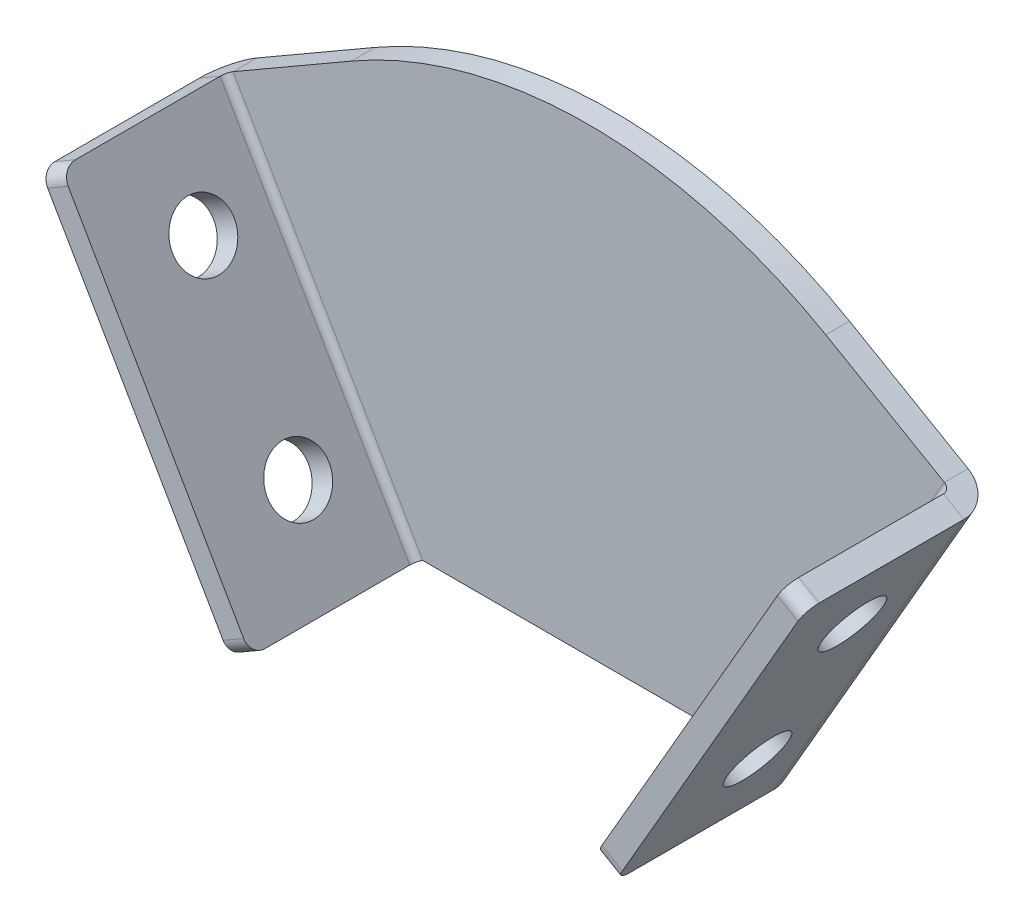
ISO-10303-21;
HEADER;
FILE_DESCRIPTION(('STEP AP214'),'2;1');
FILE_NAME('part.step','',(''),(''),'','','');
FILE_SCHEMA(('AUTOMOTIVE_DESIGN { 1 0 10303 214 1 1 1 1 }'));
ENDSEC;
DATA;
#1=APPLICATION_CONTEXT('core data for automotive mechanical design processes');
#2=APPLICATION_PROTOCOL_DEFINITION('international standard','automotive_design',2000,#1);
#3=PRODUCT_CONTEXT('',#1,'mechanical');
#4=PRODUCT('Part','Part','',(#3));
#5=PRODUCT_RELATED_PRODUCT_CATEGORY('part','',(#4));
#6=PRODUCT_DEFINITION_FORMATION('','',#4);
#7=PRODUCT_DEFINITION_CONTEXT('part definition',#1,'design');
#8=PRODUCT_DEFINITION('design','',#6,#7);
#9=PRODUCT_DEFINITION_SHAPE('','',#8);
#10=(LENGTH_UNIT() NAMED_UNIT(*) SI_UNIT(.MILLI.,.METRE.));
#11=(NAMED_UNIT(*) PLANE_ANGLE_UNIT() SI_UNIT($,.RADIAN.));
#12=(NAMED_UNIT(*) SI_UNIT($,.STERADIAN.) SOLID_ANGLE_UNIT());
#13=UNCERTAINTY_MEASURE_WITH_UNIT(LENGTH_MEASURE(1.E-05),#10,'distance_accuracy_value','');
#14=(GEOMETRIC_REPRESENTATION_CONTEXT(3) GLOBAL_UNCERTAINTY_ASSIGNED_CONTEXT((#13)) GLOBAL_UNIT_ASSIGNED_CONTEXT((#10,
#11,#12)) REPRESENTATION_CONTEXT('',''));
#15=CARTESIAN_POINT('',(0.,0.,0.));
#16=DIRECTION('',(0.,0.,1.));
#17=DIRECTION('',(1.,0.,0.));
#18=AXIS2_PLACEMENT_3D('',#15,#16,#17);
#19=CARTESIAN_POINT('',(17.5,0.,-2.5));
#20=DIRECTION('',(0.,-1.,0.));
#21=DIRECTION('',(1.,0.,0.));
#22=AXIS2_PLACEMENT_3D('',#19,#20,#21);
#23=PLANE('',#22);
#24=DIRECTION('',(1.,0.,0.));
#25=VECTOR('',#24,1.);
#26=CARTESIAN_POINT('',(17.5,0.,0.));
#27=LINE('',#26,#25);
#28=CARTESIAN_POINT('',(-17.5,0.,0.));
#29=VERTEX_POINT('',#28);
#30=CARTESIAN_POINT('',(17.5,0.,0.));
#31=VERTEX_POINT('',#30);
#32=EDGE_CURVE('E345',#29,#31,#27,.T.);
#33=ORIENTED_EDGE('',*,*,#32,.F.);
#34=DIRECTION('',(0.,0.,1.));
#35=VECTOR('',#34,1.);
#36=CARTESIAN_POINT('',(-17.5,0.,-2.5));
#37=LINE('',#36,#35);
#38=CARTESIAN_POINT('',(-17.5,0.,-2.5));
#39=VERTEX_POINT('',#38);
#40=EDGE_CURVE('E392',#39,#29,#37,.T.);
#41=ORIENTED_EDGE('',*,*,#40,.F.);
#42=DIRECTION('',(1.,0.,0.));
#43=VECTOR('',#42,1.);
#44=CARTESIAN_POINT('',(17.5,0.,-2.5));
#45=LINE('',#44,#43);
#46=CARTESIAN_POINT('',(17.5,0.,-2.5));
#47=VERTEX_POINT('',#46);
#48=EDGE_CURVE('E357',#39,#47,#45,.T.);
#49=ORIENTED_EDGE('',*,*,#48,.T.);
#50=DIRECTION('',(0.,0.,1.));
#51=VECTOR('',#50,1.);
#52=CARTESIAN_POINT('',(17.5,0.,-2.5));
#53=LINE('',#52,#51);
#54=EDGE_CURVE('E375',#47,#31,#53,.T.);
#55=ORIENTED_EDGE('',*,*,#54,.T.);
#56=EDGE_LOOP('',(#33,#41,#49,#55));
#57=FACE_BOUND('',#56,.T.);
#58=ADVANCED_FACE('F98',(#57),#23,.T.);
#59=CARTESIAN_POINT('',(-37.5000000000001,34.6410161513775,-2.5));
#60=DIRECTION('',(-0.500000000000003,0.866025403784437,0.));
#61=DIRECTION('',(-0.866025403784437,-0.500000000000003,0.));
#62=AXIS2_PLACEMENT_3D('',#59,#60,#61);
#63=PLANE('',#62);
#64=DIRECTION('',(-0.866025403784437,-0.500000000000003,0.));
#65=VECTOR('',#64,1.);
#66=CARTESIAN_POINT('',(-37.5000000000001,34.6410161513775,0.));
#67=LINE('',#66,#65);
#68=CARTESIAN_POINT('',(-25.0000000000001,41.8578945162478,0.));
#69=VERTEX_POINT('',#68);
#70=CARTESIAN_POINT('',(-37.5000000000001,34.6410161513775,0.));
#71=VERTEX_POINT('',#70);
#72=EDGE_CURVE('E386',#69,#71,#67,.T.);
#73=ORIENTED_EDGE('',*,*,#72,.F.);
#74=DIRECTION('',(0.,0.,1.));
#75=VECTOR('',#74,1.);
#76=CARTESIAN_POINT('',(-25.0000000000001,41.8578945162478,-2.5));
#77=LINE('',#76,#75);
#78=CARTESIAN_POINT('',(-25.0000000000001,41.8578945162478,-2.5));
#79=VERTEX_POINT('',#78);
#80=EDGE_CURVE('E107',#69,#79,#77,.F.);
#81=ORIENTED_EDGE('',*,*,#80,.T.);
#82=DIRECTION('',(-0.866025403784437,-0.500000000000003,0.));
#83=VECTOR('',#82,1.);
#84=CARTESIAN_POINT('',(-37.5000000000001,34.6410161513775,-2.5));
#85=LINE('',#84,#83);
#86=CARTESIAN_POINT('',(-37.5000000000001,34.6410161513775,-2.5));
#87=VERTEX_POINT('',#86);
#88=EDGE_CURVE('E368',#79,#87,#85,.T.);
#89=ORIENTED_EDGE('',*,*,#88,.T.);
#90=DIRECTION('',(0.,0.,1.));
#91=VECTOR('',#90,1.);
#92=CARTESIAN_POINT('',(-37.5000000000001,34.6410161513775,-2.5));
#93=LINE('',#92,#91);
#94=EDGE_CURVE('E397',#87,#71,#93,.T.);
#95=ORIENTED_EDGE('',*,*,#94,.T.);
#96=EDGE_LOOP('',(#73,#81,#89,#95));
#97=FACE_BOUND('',#96,.T.);
#98=ADVANCED_FACE('F571',(#97),#63,.T.);
#99=CARTESIAN_POINT('',(0.,56.2916512459887,-2.5));
#100=DIRECTION('',(0.500000000000003,0.866025403784437,0.));
#101=DIRECTION('',(-0.866025403784437,0.500000000000003,0.));
#102=AXIS2_PLACEMENT_3D('',#99,#100,#101);
#103=PLANE('',#102);
#104=DIRECTION('',(-0.866025403784437,0.500000000000003,0.));
#105=VECTOR('',#104,1.);
#106=CARTESIAN_POINT('',(0.,56.2916512459887,-2.5));
#107=LINE('',#106,#105);
#108=CARTESIAN_POINT('',(37.5000000000001,34.6410161513775,-2.5));
#109=VERTEX_POINT('',#108);
#110=CARTESIAN_POINT('',(25.0000000000001,41.8578945162478,-2.5));
#111=VERTEX_POINT('',#110);
#112=EDGE_CURVE('E364',#109,#111,#107,.T.);
#113=ORIENTED_EDGE('',*,*,#112,.T.);
#114=DIRECTION('',(0.,0.,1.));
#115=VECTOR('',#114,1.);
#116=CARTESIAN_POINT('',(25.0000000000001,41.8578945162478,-2.5));
#117=LINE('',#116,#115);
#118=CARTESIAN_POINT('',(25.0000000000001,41.8578945162478,0.));
#119=VERTEX_POINT('',#118);
#120=EDGE_CURVE('E456',#111,#119,#117,.T.);
#121=ORIENTED_EDGE('',*,*,#120,.T.);
#122=DIRECTION('',(-0.866025403784437,0.500000000000003,0.));
#123=VECTOR('',#122,1.);
#124=CARTESIAN_POINT('',(0.,56.2916512459887,0.));
#125=LINE('',#124,#123);
#126=CARTESIAN_POINT('',(37.5000000000001,34.6410161513775,0.));
#127=VERTEX_POINT('',#126);
#128=EDGE_CURVE('E383',#127,#119,#125,.T.);
#129=ORIENTED_EDGE('',*,*,#128,.F.);
#130=DIRECTION('',(0.,0.,1.));
#131=VECTOR('',#130,1.);
#132=CARTESIAN_POINT('',(37.5000000000001,34.6410161513775,-2.5));
#133=LINE('',#132,#131);
#134=EDGE_CURVE('E401',#109,#127,#133,.T.);
#135=ORIENTED_EDGE('',*,*,#134,.F.);
#136=EDGE_LOOP('',(#113,#121,#129,#135));
#137=FACE_BOUND('',#136,.T.);
#138=ADVANCED_FACE('F579',(#137),#103,.T.);
#139=CARTESIAN_POINT('',(0.,0.,-2.5));
#140=DIRECTION('',(0.,0.,-1.));
#141=DIRECTION('',(-1.,0.,0.));
#142=AXIS2_PLACEMENT_3D('',#139,#140,#141);
#143=PLANE('',#142);
#144=ORIENTED_EDGE('',*,*,#88,.F.);
#145=CARTESIAN_POINT('',(0.,-1.44337567297401,-2.5));
#146=DIRECTION('',(0.,0.,-1.));
#147=DIRECTION('',(-1.,0.,0.));
#148=AXIS2_PLACEMENT_3D('',#145,#146,#147);
#149=CIRCLE('',#148,50.);
#150=EDGE_CURVE('E13',#79,#111,#149,.T.);
#151=ORIENTED_EDGE('',*,*,#150,.T.);
#152=ORIENTED_EDGE('',*,*,#112,.F.);
#153=DIRECTION('',(0.500000000000003,0.866025403784437,0.));
#154=VECTOR('',#153,1.);
#155=CARTESIAN_POINT('',(37.5000000000001,34.6410161513775,-2.5));
#156=LINE('',#155,#154);
#157=EDGE_CURVE('E245',#47,#109,#156,.T.);
#158=ORIENTED_EDGE('',*,*,#157,.F.);
#159=ORIENTED_EDGE('',*,*,#48,.F.);
#160=DIRECTION('',(0.500000000000003,-0.866025403784437,0.));
#161=VECTOR('',#160,1.);
#162=CARTESIAN_POINT('',(-17.5,0.,-2.5));
#163=LINE('',#162,#161);
#164=EDGE_CURVE('E371',#87,#39,#163,.T.);
#165=ORIENTED_EDGE('',*,*,#164,.F.);
#166=EDGE_LOOP('',(#144,#151,#152,#158,#159,#165));
#167=FACE_BOUND('',#166,.T.);
#168=ADVANCED_FACE('F575',(#167),#143,.T.);
#169=CARTESIAN_POINT('',(0.,0.,0.));
#170=DIRECTION('',(0.,0.,-1.));
#171=DIRECTION('',(-1.,0.,0.));
#172=AXIS2_PLACEMENT_3D('',#169,#170,#171);
#173=PLANE('',#172);
#174=ORIENTED_EDGE('',*,*,#128,.T.);
#175=CARTESIAN_POINT('',(0.,-1.44337567297401,0.));
#176=DIRECTION('',(0.,0.,-1.));
#177=DIRECTION('',(-1.,0.,0.));
#178=AXIS2_PLACEMENT_3D('',#175,#176,#177);
#179=CIRCLE('',#178,50.);
#180=EDGE_CURVE('E121',#119,#69,#179,.F.);
#181=ORIENTED_EDGE('',*,*,#180,.T.);
#182=ORIENTED_EDGE('',*,*,#72,.T.);
#183=DIRECTION('',(0.500000000000003,-0.866025403784437,0.));
#184=VECTOR('',#183,1.);
#185=CARTESIAN_POINT('',(-17.5,0.,0.));
#186=LINE('',#185,#184);
#187=EDGE_CURVE('E361',#71,#29,#186,.T.);
#188=ORIENTED_EDGE('',*,*,#187,.T.);
#189=ORIENTED_EDGE('',*,*,#32,.T.);
#190=DIRECTION('',(0.500000000000003,0.866025403784437,0.));
#191=VECTOR('',#190,1.);
#192=CARTESIAN_POINT('',(37.5000000000001,34.6410161513775,0.));
#193=LINE('',#192,#191);
#194=EDGE_CURVE('E379',#31,#127,#193,.T.);
#195=ORIENTED_EDGE('',*,*,#194,.T.);
#196=EDGE_LOOP('',(#174,#181,#182,#188,#189,#195));
#197=FACE_BOUND('',#196,.T.);
#198=ADVANCED_FACE('F528',(#197),#173,.F.);
#199=CARTESIAN_POINT('',(-37.5000000000001,34.6410161513775,0.7366));
#200=DIRECTION('',(-0.500000000000003,0.866025403784437,0.));
#201=DIRECTION('',(-0.866025403784437,-0.500000000000003,0.));
#202=AXIS2_PLACEMENT_3D('',#199,#200,#201);
#203=PLANE('',#202);
#204=DIRECTION('',(-0.866025403784437,-0.500000000000003,0.));
#205=VECTOR('',#204,1.);
#206=CARTESIAN_POINT('',(-40.3029778218888,33.0227161513775,0.736599999999987));
#207=LINE('',#206,#205);
#208=CARTESIAN_POINT('',(-38.1379143124277,34.2727161513775,0.736599999999997));
#209=VERTEX_POINT('',#208);
#210=CARTESIAN_POINT('',(-40.3029778218888,33.0227161513775,0.736599999999988));
#211=VERTEX_POINT('',#210);
#212=EDGE_CURVE('E282',#209,#211,#207,.T.);
#213=ORIENTED_EDGE('',*,*,#212,.F.);
#214=CARTESIAN_POINT('',(-37.5000000000001,34.6410161513775,0.7366));
#215=DIRECTION('',(0.500000000000003,-0.866025403784437,0.));
#216=DIRECTION('',(0.866025403784437,0.500000000000003,0.));
#217=AXIS2_PLACEMENT_3D('',#214,#215,#216);
#218=CIRCLE('',#217,0.736599999999999);
#219=EDGE_CURVE('E350',#71,#209,#218,.F.);
#220=ORIENTED_EDGE('',*,*,#219,.F.);
#221=ORIENTED_EDGE('',*,*,#94,.F.);
#222=CARTESIAN_POINT('',(-37.5000000000001,34.6410161513775,0.7366));
#223=DIRECTION('',(0.500000000000003,-0.866025403784437,0.));
#224=DIRECTION('',(0.866025403784437,0.500000000000003,0.));
#225=AXIS2_PLACEMENT_3D('',#222,#223,#224);
#226=CIRCLE('',#225,3.2366);
#227=EDGE_CURVE('E341',#87,#211,#226,.F.);
#228=ORIENTED_EDGE('',*,*,#227,.T.);
#229=EDGE_LOOP('',(#213,#220,#221,#228));
#230=FACE_BOUND('',#229,.T.);
#231=ADVANCED_FACE('F570',(#230),#203,.T.);
#232=CARTESIAN_POINT('',(-17.5,0.,0.736600000000001));
#233=DIRECTION('',(-0.500000000000003,0.866025403784437,0.));
#234=DIRECTION('',(-0.866025403784437,-0.500000000000003,0.));
#235=AXIS2_PLACEMENT_3D('',#232,#233,#234);
#236=PLANE('',#235);
#237=CARTESIAN_POINT('',(-17.5,0.,0.736600000000001));
#238=DIRECTION('',(0.500000000000003,-0.866025403784437,0.));
#239=DIRECTION('',(0.866025403784437,0.500000000000003,0.));
#240=AXIS2_PLACEMENT_3D('',#237,#238,#239);
#241=CIRCLE('',#240,0.736599999999999);
#242=CARTESIAN_POINT('',(-18.1379143124276,-0.368300000000004,0.736599999999999));
#243=VERTEX_POINT('',#242);
#244=EDGE_CURVE('E292',#243,#29,#241,.T.);
#245=ORIENTED_EDGE('',*,*,#244,.F.);
#246=DIRECTION('',(-0.866025403784437,-0.500000000000003,0.));
#247=VECTOR('',#246,1.);
#248=CARTESIAN_POINT('',(-18.1379143124276,-0.368300000000002,0.736599999999999));
#249=LINE('',#248,#247);
#250=CARTESIAN_POINT('',(-20.3029778218887,-1.61830000000001,0.73659999999999));
#251=VERTEX_POINT('',#250);
#252=EDGE_CURVE('E330',#243,#251,#249,.T.);
#253=ORIENTED_EDGE('',*,*,#252,.T.);
#254=CARTESIAN_POINT('',(-17.5,0.,0.736600000000001));
#255=DIRECTION('',(0.500000000000003,-0.866025403784437,0.));
#256=DIRECTION('',(0.866025403784437,0.500000000000003,0.));
#257=AXIS2_PLACEMENT_3D('',#254,#255,#256);
#258=CIRCLE('',#257,3.2366);
#259=EDGE_CURVE('E346',#251,#39,#258,.T.);
#260=ORIENTED_EDGE('',*,*,#259,.T.);
#261=ORIENTED_EDGE('',*,*,#40,.T.);
#262=EDGE_LOOP('',(#245,#253,#260,#261));
#263=FACE_BOUND('',#262,.T.);
#264=ADVANCED_FACE('F534',(#263),#236,.F.);
#265=CARTESIAN_POINT('',(-17.5,0.,0.736600000000001));
#266=DIRECTION('',(0.500000000000003,-0.866025403784437,0.));
#267=DIRECTION('',(-0.866025403784437,-0.500000000000003,0.));
#268=AXIS2_PLACEMENT_3D('',#265,#266,#267);
#269=CYLINDRICAL_SURFACE('',#268,3.2366);
#270=ORIENTED_EDGE('',*,*,#164,.T.);
#271=ORIENTED_EDGE('',*,*,#259,.F.);
#272=DIRECTION('',(0.500000000000003,-0.866025403784437,0.));
#273=VECTOR('',#272,1.);
#274=CARTESIAN_POINT('',(-15.9279778218887,-9.19602228311388,0.73659999999999));
#275=LINE('',#274,#273);
#276=EDGE_CURVE('E326',#211,#251,#275,.T.);
#277=ORIENTED_EDGE('',*,*,#276,.F.);
#278=ORIENTED_EDGE('',*,*,#227,.F.);
#279=EDGE_LOOP('',(#270,#271,#277,#278));
#280=FACE_BOUND('',#279,.T.);
#281=ADVANCED_FACE('F567',(#280),#269,.T.);
#282=CARTESIAN_POINT('',(-17.5,0.,0.736600000000001));
#283=DIRECTION('',(0.500000000000003,-0.866025403784437,0.));
#284=DIRECTION('',(-0.866025403784437,-0.500000000000003,0.));
#285=AXIS2_PLACEMENT_3D('',#282,#283,#284);
#286=CYLINDRICAL_SURFACE('',#285,0.736599999999999);
#287=ORIENTED_EDGE('',*,*,#187,.F.);
#288=ORIENTED_EDGE('',*,*,#219,.T.);
#289=DIRECTION('',(-0.500000000000003,0.866025403784437,0.));
#290=VECTOR('',#289,1.);
#291=CARTESIAN_POINT('',(-38.1379143124277,34.2727161513775,0.736599999999997));
#292=LINE('',#291,#290);
#293=EDGE_CURVE('E334',#209,#243,#292,.F.);
#294=ORIENTED_EDGE('',*,*,#293,.T.);
#295=ORIENTED_EDGE('',*,*,#244,.T.);
#296=EDGE_LOOP('',(#287,#288,#294,#295));
#297=FACE_BOUND('',#296,.T.);
#298=ADVANCED_FACE('F537',(#297),#286,.F.);
#299=CARTESIAN_POINT('',(-20.3029778218887,-1.61830000000001,0.));
#300=DIRECTION('',(0.500000000000003,-0.866025403784437,0.));
#301=DIRECTION('',(0.866025403784437,0.500000000000003,0.));
#302=AXIS2_PLACEMENT_3D('',#299,#300,#301);
#303=PLANE('',#302);
#304=DIRECTION('',(0.,0.,1.));
#305=VECTOR('',#304,1.);
#306=CARTESIAN_POINT('',(-18.1379143124276,-0.368300000000004,0.));
#307=LINE('',#306,#305);
#308=CARTESIAN_POINT('',(-18.1379143124277,-0.368300000000031,16.));
#309=VERTEX_POINT('',#308);
#310=EDGE_CURVE('E300',#309,#243,#307,.F.);
#311=ORIENTED_EDGE('',*,*,#310,.F.);
#312=DIRECTION('',(0.866025403784437,0.500000000000003,0.));
#313=VECTOR('',#312,1.);
#314=CARTESIAN_POINT('',(-20.3029778218888,-1.61830000000004,16.));
#315=LINE('',#314,#313);
#316=CARTESIAN_POINT('',(-20.3029778218888,-1.61830000000004,16.));
#317=VERTEX_POINT('',#316);
#318=EDGE_CURVE('E443',#309,#317,#315,.F.);
#319=ORIENTED_EDGE('',*,*,#318,.T.);
#320=DIRECTION('',(0.,0.,-1.));
#321=VECTOR('',#320,1.);
#322=CARTESIAN_POINT('',(-20.3029778218887,-1.61830000000001,0.));
#323=LINE('',#322,#321);
#324=EDGE_CURVE('E289',#317,#251,#323,.T.);
#325=ORIENTED_EDGE('',*,*,#324,.T.);
#326=ORIENTED_EDGE('',*,*,#252,.F.);
#327=EDGE_LOOP('',(#311,#319,#325,#326));
#328=FACE_BOUND('',#327,.T.);
#329=ADVANCED_FACE('F561',(#328),#303,.T.);
#330=CARTESIAN_POINT('',(-40.3029778218889,33.0227161513774,17.5));
#331=DIRECTION('',(-0.500000000000003,0.866025403784437,0.));
#332=DIRECTION('',(-0.866025403784437,-0.500000000000003,0.));
#333=AXIS2_PLACEMENT_3D('',#330,#331,#332);
#334=PLANE('',#333);
#335=DIRECTION('',(0.,0.,1.));
#336=VECTOR('',#335,1.);
#337=CARTESIAN_POINT('',(-40.3029778218889,33.0227161513774,17.5));
#338=LINE('',#337,#336);
#339=CARTESIAN_POINT('',(-40.3029778218889,33.0227161513774,16.));
#340=VERTEX_POINT('',#339);
#341=EDGE_CURVE('E296',#211,#340,#338,.T.);
#342=ORIENTED_EDGE('',*,*,#341,.T.);
#343=DIRECTION('',(0.866025403784437,0.500000000000003,0.));
#344=VECTOR('',#343,1.);
#345=CARTESIAN_POINT('',(-40.3029778218889,33.0227161513774,16.));
#346=LINE('',#345,#344);
#347=CARTESIAN_POINT('',(-38.1379143124278,34.2727161513774,16.));
#348=VERTEX_POINT('',#347);
#349=EDGE_CURVE('E452',#340,#348,#346,.T.);
#350=ORIENTED_EDGE('',*,*,#349,.T.);
#351=DIRECTION('',(0.,0.,-1.));
#352=VECTOR('',#351,1.);
#353=CARTESIAN_POINT('',(-38.1379143124277,34.2727161513775,0.));
#354=LINE('',#353,#352);
#355=EDGE_CURVE('E307',#209,#348,#354,.F.);
#356=ORIENTED_EDGE('',*,*,#355,.F.);
#357=ORIENTED_EDGE('',*,*,#212,.T.);
#358=EDGE_LOOP('',(#342,#350,#356,#357));
#359=FACE_BOUND('',#358,.T.);
#360=ADVANCED_FACE('F544',(#359),#334,.T.);
#361=CARTESIAN_POINT('',(-15.9279778218887,-9.19602228311388,0.));
#362=DIRECTION('',(-0.866025403784437,-0.500000000000003,0.));
#363=DIRECTION('',(0.500000000000003,-0.866025403784437,0.));
#364=AXIS2_PLACEMENT_3D('',#361,#362,#363);
#365=PLANE('',#364);
#366=CARTESIAN_POINT('',(-25.3029778218888,7.04195403784435,7.49999999999999));
#367=DIRECTION('',(-0.866025403784437,-0.500000000000003,0.));
#368=DIRECTION('',(0.500000000000003,-0.866025403784437,0.));
#369=AXIS2_PLACEMENT_3D('',#366,#367,#368);
#370=CIRCLE('',#369,3.25);
#371=CARTESIAN_POINT('',(-23.6779778218888,4.22737147554492,7.49999999999999));
#372=VERTEX_POINT('',#371);
#373=EDGE_CURVE('E318',#372,#372,#370,.F.);
#374=ORIENTED_EDGE('',*,*,#373,.T.);
#375=EDGE_LOOP('',(#374));
#376=FACE_BOUND('',#375,.T.);
#377=CARTESIAN_POINT('',(-35.3029778218888,24.3624621135331,7.49999999999999));
#378=DIRECTION('',(-0.866025403784437,-0.500000000000003,0.));
#379=DIRECTION('',(0.500000000000003,-0.866025403784437,0.));
#380=AXIS2_PLACEMENT_3D('',#377,#378,#379);
#381=CIRCLE('',#380,3.25);
#382=CARTESIAN_POINT('',(-33.6779778218888,21.5478795512337,7.49999999999999));
#383=VERTEX_POINT('',#382);
#384=EDGE_CURVE('E311',#383,#383,#381,.F.);
#385=ORIENTED_EDGE('',*,*,#384,.T.);
#386=EDGE_LOOP('',(#385));
#387=FACE_BOUND('',#386,.T.);
#388=ORIENTED_EDGE('',*,*,#324,.F.);
#389=CARTESIAN_POINT('',(-21.0529778218888,-0.319261894323383,16.));
#390=DIRECTION('',(-0.866025403784437,-0.500000000000003,0.));
#391=DIRECTION('',(0.500000000000003,-0.866025403784437,0.));
#392=AXIS2_PLACEMENT_3D('',#389,#390,#391);
#393=CIRCLE('',#392,1.5);
#394=CARTESIAN_POINT('',(-21.0529778218888,-0.319261894323386,17.5));
#395=VERTEX_POINT('',#394);
#396=EDGE_CURVE('E449',#317,#395,#393,.T.);
#397=ORIENTED_EDGE('',*,*,#396,.T.);
#398=DIRECTION('',(0.500000000000003,-0.866025403784437,0.));
#399=VECTOR('',#398,1.);
#400=CARTESIAN_POINT('',(-20.3029778218888,-1.61830000000004,17.5));
#401=LINE('',#400,#399);
#402=CARTESIAN_POINT('',(-39.5529778218889,31.7236780457008,17.5));
#403=VERTEX_POINT('',#402);
#404=EDGE_CURVE('E293',#403,#395,#401,.T.);
#405=ORIENTED_EDGE('',*,*,#404,.F.);
#406=CARTESIAN_POINT('',(-39.5529778218889,31.7236780457008,16.));
#407=DIRECTION('',(-0.866025403784437,-0.500000000000003,0.));
#408=DIRECTION('',(0.500000000000003,-0.866025403784437,0.));
#409=AXIS2_PLACEMENT_3D('',#406,#407,#408);
#410=CIRCLE('',#409,1.5);
#411=EDGE_CURVE('E446',#403,#340,#410,.T.);
#412=ORIENTED_EDGE('',*,*,#411,.T.);
#413=ORIENTED_EDGE('',*,*,#341,.F.);
#414=ORIENTED_EDGE('',*,*,#276,.T.);
#415=EDGE_LOOP('',(#388,#397,#405,#412,#413,#414));
#416=FACE_BOUND('',#415,.T.);
#417=ADVANCED_FACE('F564',(#376,#387,#416),#365,.T.);
#418=CARTESIAN_POINT('',(-13.7629143124276,-7.94602228311387,0.));
#419=DIRECTION('',(-0.866025403784437,-0.500000000000003,0.));
#420=DIRECTION('',(0.500000000000003,-0.866025403784437,0.));
#421=AXIS2_PLACEMENT_3D('',#418,#419,#420);
#422=PLANE('',#421);
#423=CARTESIAN_POINT('',(-33.1379143124277,25.6124621135331,7.5));
#424=DIRECTION('',(-0.866025403784437,-0.500000000000003,0.));
#425=DIRECTION('',(0.500000000000003,-0.866025403784437,0.));
#426=AXIS2_PLACEMENT_3D('',#423,#424,#425);
#427=CIRCLE('',#426,3.25);
#428=CARTESIAN_POINT('',(-31.5129143124277,22.7978795512337,7.5));
#429=VERTEX_POINT('',#428);
#430=EDGE_CURVE('E314',#429,#429,#427,.F.);
#431=ORIENTED_EDGE('',*,*,#430,.F.);
#432=EDGE_LOOP('',(#431));
#433=FACE_BOUND('',#432,.T.);
#434=CARTESIAN_POINT('',(-23.1379143124277,8.29195403784435,7.49999999999999));
#435=DIRECTION('',(-0.866025403784437,-0.500000000000003,0.));
#436=DIRECTION('',(0.500000000000003,-0.866025403784437,0.));
#437=AXIS2_PLACEMENT_3D('',#434,#435,#436);
#438=CIRCLE('',#437,3.25);
#439=CARTESIAN_POINT('',(-21.5129143124277,5.47737147554493,7.49999999999999));
#440=VERTEX_POINT('',#439);
#441=EDGE_CURVE('E322',#440,#440,#438,.F.);
#442=ORIENTED_EDGE('',*,*,#441,.F.);
#443=EDGE_LOOP('',(#442));
#444=FACE_BOUND('',#443,.T.);
#445=DIRECTION('',(-0.500000000000003,0.866025403784437,0.));
#446=VECTOR('',#445,1.);
#447=CARTESIAN_POINT('',(-13.7629143124276,-7.9460222831139,17.5));
#448=LINE('',#447,#446);
#449=CARTESIAN_POINT('',(-37.3879143124278,32.9736780457008,17.5));
#450=VERTEX_POINT('',#449);
#451=CARTESIAN_POINT('',(-18.8879143124277,0.930738105676621,17.5));
#452=VERTEX_POINT('',#451);
#453=EDGE_CURVE('E303',#450,#452,#448,.F.);
#454=ORIENTED_EDGE('',*,*,#453,.T.);
#455=CARTESIAN_POINT('',(-18.8879143124277,0.930738105676624,16.));
#456=DIRECTION('',(-0.866025403784437,-0.500000000000003,0.));
#457=DIRECTION('',(0.500000000000003,-0.866025403784437,0.));
#458=AXIS2_PLACEMENT_3D('',#455,#456,#457);
#459=CIRCLE('',#458,1.5);
#460=EDGE_CURVE('E440',#452,#309,#459,.F.);
#461=ORIENTED_EDGE('',*,*,#460,.T.);
#462=ORIENTED_EDGE('',*,*,#310,.T.);
#463=ORIENTED_EDGE('',*,*,#293,.F.);
#464=ORIENTED_EDGE('',*,*,#355,.T.);
#465=CARTESIAN_POINT('',(-37.3879143124278,32.9736780457008,16.));
#466=DIRECTION('',(-0.866025403784437,-0.500000000000003,0.));
#467=DIRECTION('',(0.500000000000003,-0.866025403784437,0.));
#468=AXIS2_PLACEMENT_3D('',#465,#466,#467);
#469=CIRCLE('',#468,1.5);
#470=EDGE_CURVE('E437',#348,#450,#469,.F.);
#471=ORIENTED_EDGE('',*,*,#470,.T.);
#472=EDGE_LOOP('',(#454,#461,#462,#463,#464,#471));
#473=FACE_BOUND('',#472,.T.);
#474=ADVANCED_FACE('F541',(#433,#444,#473),#422,.F.);
#475=CARTESIAN_POINT('',(-20.3029778218888,-1.61830000000004,17.5));
#476=DIRECTION('',(0.,0.,1.));
#477=DIRECTION('',(1.,0.,0.));
#478=AXIS2_PLACEMENT_3D('',#475,#476,#477);
#479=PLANE('',#478);
#480=ORIENTED_EDGE('',*,*,#404,.T.);
#481=DIRECTION('',(0.866025403784437,0.500000000000003,0.));
#482=VECTOR('',#481,1.);
#483=CARTESIAN_POINT('',(-21.0529778218888,-0.319261894323384,17.5));
#484=LINE('',#483,#482);
#485=EDGE_CURVE('E433',#395,#452,#484,.T.);
#486=ORIENTED_EDGE('',*,*,#485,.T.);
#487=ORIENTED_EDGE('',*,*,#453,.F.);
#488=DIRECTION('',(0.866025403784437,0.500000000000003,0.));
#489=VECTOR('',#488,1.);
#490=CARTESIAN_POINT('',(-39.5529778218889,31.7236780457008,17.5));
#491=LINE('',#490,#489);
#492=EDGE_CURVE('E430',#450,#403,#491,.F.);
#493=ORIENTED_EDGE('',*,*,#492,.T.);
#494=EDGE_LOOP('',(#480,#486,#487,#493));
#495=FACE_BOUND('',#494,.T.);
#496=ADVANCED_FACE('F553',(#495),#479,.T.);
#497=CARTESIAN_POINT('',(-35.3029778218888,24.3624621135331,7.49999999999999));
#498=DIRECTION('',(0.866025403784437,0.500000000000003,0.));
#499=DIRECTION('',(-0.500000000000003,0.866025403784437,0.));
#500=AXIS2_PLACEMENT_3D('',#497,#498,#499);
#501=CYLINDRICAL_SURFACE('',#500,3.25);
#502=ORIENTED_EDGE('',*,*,#384,.F.);
#503=EDGE_LOOP('',(#502));
#504=FACE_BOUND('',#503,.T.);
#505=ORIENTED_EDGE('',*,*,#430,.T.);
#506=EDGE_LOOP('',(#505));
#507=FACE_BOUND('',#506,.T.);
#508=ADVANCED_FACE('F692',(#504,#507),#501,.F.);
#509=CARTESIAN_POINT('',(-25.3029778218888,7.04195403784435,7.49999999999999));
#510=DIRECTION('',(0.866025403784437,0.500000000000003,0.));
#511=DIRECTION('',(-0.500000000000003,0.866025403784437,0.));
#512=AXIS2_PLACEMENT_3D('',#509,#510,#511);
#513=CYLINDRICAL_SURFACE('',#512,3.25);
#514=ORIENTED_EDGE('',*,*,#373,.F.);
#515=EDGE_LOOP('',(#514));
#516=FACE_BOUND('',#515,.T.);
#517=ORIENTED_EDGE('',*,*,#441,.T.);
#518=EDGE_LOOP('',(#517));
#519=FACE_BOUND('',#518,.T.);
#520=ADVANCED_FACE('F698',(#516,#519),#513,.F.);
#521=CARTESIAN_POINT('',(17.5,0.,0.736599999999999));
#522=DIRECTION('',(-0.500000000000002,-0.866025403784437,0.));
#523=DIRECTION('',(0.866025403784437,-0.500000000000002,0.));
#524=AXIS2_PLACEMENT_3D('',#521,#522,#523);
#525=PLANE('',#524);
#526=DIRECTION('',(0.866025403784437,-0.500000000000003,0.));
#527=VECTOR('',#526,1.);
#528=CARTESIAN_POINT('',(20.3029778218887,-1.6183,0.736599999999988));
#529=LINE('',#528,#527);
#530=CARTESIAN_POINT('',(18.1379143124276,-0.368300000000002,0.736599999999997));
#531=VERTEX_POINT('',#530);
#532=CARTESIAN_POINT('',(20.3029778218887,-1.61830000000001,0.736599999999988));
#533=VERTEX_POINT('',#532);
#534=EDGE_CURVE('E277',#531,#533,#529,.T.);
#535=ORIENTED_EDGE('',*,*,#534,.F.);
#536=CARTESIAN_POINT('',(17.5,0.,0.736599999999999));
#537=DIRECTION('',(0.500000000000002,0.866025403784437,0.));
#538=DIRECTION('',(-0.866025403784437,0.500000000000002,0.));
#539=AXIS2_PLACEMENT_3D('',#536,#537,#538);
#540=CIRCLE('',#539,0.736599999999997);
#541=EDGE_CURVE('E250',#31,#531,#540,.F.);
#542=ORIENTED_EDGE('',*,*,#541,.F.);
#543=ORIENTED_EDGE('',*,*,#54,.F.);
#544=CARTESIAN_POINT('',(17.5,0.,0.736599999999999));
#545=DIRECTION('',(0.500000000000002,0.866025403784437,0.));
#546=DIRECTION('',(-0.866025403784437,0.500000000000002,0.));
#547=AXIS2_PLACEMENT_3D('',#544,#545,#546);
#548=CIRCLE('',#547,3.2366);
#549=EDGE_CURVE('E249',#47,#533,#548,.F.);
#550=ORIENTED_EDGE('',*,*,#549,.T.);
#551=EDGE_LOOP('',(#535,#542,#543,#550));
#552=FACE_BOUND('',#551,.T.);
#553=ADVANCED_FACE('F525',(#552),#525,.T.);
#554=CARTESIAN_POINT('',(37.5000000000001,34.6410161513775,0.736599999999996));
#555=DIRECTION('',(-0.500000000000002,-0.866025403784437,0.));
#556=DIRECTION('',(0.866025403784437,-0.500000000000002,0.));
#557=AXIS2_PLACEMENT_3D('',#554,#555,#556);
#558=PLANE('',#557);
#559=CARTESIAN_POINT('',(37.5000000000001,34.6410161513775,0.736599999999996));
#560=DIRECTION('',(0.500000000000002,0.866025403784437,0.));
#561=DIRECTION('',(-0.866025403784437,0.500000000000002,0.));
#562=AXIS2_PLACEMENT_3D('',#559,#560,#561);
#563=CIRCLE('',#562,0.736599999999997);
#564=CARTESIAN_POINT('',(38.1379143124277,34.2727161513775,0.736599999999994));
#565=VERTEX_POINT('',#564);
#566=EDGE_CURVE('E234',#565,#127,#563,.T.);
#567=ORIENTED_EDGE('',*,*,#566,.F.);
#568=DIRECTION('',(0.866025403784437,-0.500000000000003,0.));
#569=VECTOR('',#568,1.);
#570=CARTESIAN_POINT('',(38.1379143124277,34.2727161513775,0.736599999999993));
#571=LINE('',#570,#569);
#572=CARTESIAN_POINT('',(40.3029778218888,33.0227161513775,0.736599999999984));
#573=VERTEX_POINT('',#572);
#574=EDGE_CURVE('E227',#565,#573,#571,.T.);
#575=ORIENTED_EDGE('',*,*,#574,.T.);
#576=CARTESIAN_POINT('',(37.5000000000001,34.6410161513775,0.736599999999996));
#577=DIRECTION('',(0.500000000000002,0.866025403784437,0.));
#578=DIRECTION('',(-0.866025403784437,0.500000000000002,0.));
#579=AXIS2_PLACEMENT_3D('',#576,#577,#578);
#580=CIRCLE('',#579,3.2366);
#581=EDGE_CURVE('E240',#573,#109,#580,.T.);
#582=ORIENTED_EDGE('',*,*,#581,.T.);
#583=ORIENTED_EDGE('',*,*,#134,.T.);
#584=EDGE_LOOP('',(#567,#575,#582,#583));
#585=FACE_BOUND('',#584,.T.);
#586=ADVANCED_FACE('F253',(#585),#558,.F.);
#587=CARTESIAN_POINT('',(37.5000000000001,34.6410161513775,0.736599999999996));
#588=DIRECTION('',(0.500000000000002,0.866025403784437,0.));
#589=DIRECTION('',(0.866025403784437,-0.500000000000002,0.));
#590=AXIS2_PLACEMENT_3D('',#587,#588,#589);
#591=CYLINDRICAL_SURFACE('',#590,3.2366);
#592=ORIENTED_EDGE('',*,*,#157,.T.);
#593=ORIENTED_EDGE('',*,*,#581,.F.);
#594=DIRECTION('',(0.500000000000003,0.866025403784437,0.));
#595=VECTOR('',#594,1.);
#596=CARTESIAN_POINT('',(20.3029778218887,-1.6183,0.736599999999988));
#597=LINE('',#596,#595);
#598=EDGE_CURVE('E243',#573,#533,#597,.F.);
#599=ORIENTED_EDGE('',*,*,#598,.T.);
#600=ORIENTED_EDGE('',*,*,#549,.F.);
#601=EDGE_LOOP('',(#592,#593,#599,#600));
#602=FACE_BOUND('',#601,.T.);
#603=ADVANCED_FACE('F241',(#602),#591,.T.);
#604=CARTESIAN_POINT('',(37.5000000000001,34.6410161513775,0.736599999999996));
#605=DIRECTION('',(0.500000000000002,0.866025403784437,0.));
#606=DIRECTION('',(0.866025403784437,-0.500000000000002,0.));
#607=AXIS2_PLACEMENT_3D('',#604,#605,#606);
#608=CYLINDRICAL_SURFACE('',#607,0.736599999999997);
#609=ORIENTED_EDGE('',*,*,#194,.F.);
#610=ORIENTED_EDGE('',*,*,#541,.T.);
#611=DIRECTION('',(0.500000000000003,0.866025403784437,0.));
#612=VECTOR('',#611,1.);
#613=CARTESIAN_POINT('',(18.1379143124276,-0.368299999999998,0.736599999999997));
#614=LINE('',#613,#612);
#615=EDGE_CURVE('E256',#531,#565,#614,.T.);
#616=ORIENTED_EDGE('',*,*,#615,.T.);
#617=ORIENTED_EDGE('',*,*,#566,.T.);
#618=EDGE_LOOP('',(#609,#610,#616,#617));
#619=FACE_BOUND('',#618,.T.);
#620=ADVANCED_FACE('F521',(#619),#608,.F.);
#621=CARTESIAN_POINT('',(40.3029778218889,33.0227161513775,17.5));
#622=DIRECTION('',(0.500000000000003,0.866025403784437,0.));
#623=DIRECTION('',(-0.866025403784437,0.500000000000003,0.));
#624=AXIS2_PLACEMENT_3D('',#621,#622,#623);
#625=PLANE('',#624);
#626=DIRECTION('',(0.,0.,-1.));
#627=VECTOR('',#626,1.);
#628=CARTESIAN_POINT('',(38.1379143124277,34.2727161513775,0.));
#629=LINE('',#628,#627);
#630=CARTESIAN_POINT('',(38.1379143124278,34.2727161513775,16.));
#631=VERTEX_POINT('',#630);
#632=EDGE_CURVE('E463',#631,#565,#629,.T.);
#633=ORIENTED_EDGE('',*,*,#632,.F.);
#634=DIRECTION('',(-0.866025403784437,0.500000000000003,0.));
#635=VECTOR('',#634,1.);
#636=CARTESIAN_POINT('',(40.3029778218889,33.0227161513775,16.));
#637=LINE('',#636,#635);
#638=CARTESIAN_POINT('',(40.3029778218889,33.0227161513775,16.));
#639=VERTEX_POINT('',#638);
#640=EDGE_CURVE('E229',#631,#639,#637,.F.);
#641=ORIENTED_EDGE('',*,*,#640,.T.);
#642=DIRECTION('',(0.,0.,1.));
#643=VECTOR('',#642,1.);
#644=CARTESIAN_POINT('',(40.3029778218889,33.0227161513775,17.5));
#645=LINE('',#644,#643);
#646=EDGE_CURVE('E222',#639,#573,#645,.F.);
#647=ORIENTED_EDGE('',*,*,#646,.T.);
#648=ORIENTED_EDGE('',*,*,#574,.F.);
#649=EDGE_LOOP('',(#633,#641,#647,#648));
#650=FACE_BOUND('',#649,.T.);
#651=ADVANCED_FACE('F225',(#650),#625,.T.);
#652=CARTESIAN_POINT('',(20.3029778218887,-1.6183,0.));
#653=DIRECTION('',(-0.500000000000003,-0.866025403784437,0.));
#654=DIRECTION('',(0.866025403784437,-0.500000000000003,0.));
#655=AXIS2_PLACEMENT_3D('',#652,#653,#654);
#656=PLANE('',#655);
#657=DIRECTION('',(0.,0.,-1.));
#658=VECTOR('',#657,1.);
#659=CARTESIAN_POINT('',(20.3029778218887,-1.6183,0.));
#660=LINE('',#659,#658);
#661=CARTESIAN_POINT('',(20.3029778218888,-1.61830000000003,16.));
#662=VERTEX_POINT('',#661);
#663=EDGE_CURVE('E262',#533,#662,#660,.F.);
#664=ORIENTED_EDGE('',*,*,#663,.T.);
#665=DIRECTION('',(-0.866025403784437,0.500000000000003,0.));
#666=VECTOR('',#665,1.);
#667=CARTESIAN_POINT('',(20.3029778218888,-1.61830000000003,16.));
#668=LINE('',#667,#666);
#669=CARTESIAN_POINT('',(18.1379143124277,-0.368300000000024,16.));
#670=VERTEX_POINT('',#669);
#671=EDGE_CURVE('E396',#662,#670,#668,.T.);
#672=ORIENTED_EDGE('',*,*,#671,.T.);
#673=DIRECTION('',(0.,0.,1.));
#674=VECTOR('',#673,1.);
#675=CARTESIAN_POINT('',(18.1379143124276,-0.368299999999996,0.));
#676=LINE('',#675,#674);
#677=EDGE_CURVE('E469',#531,#670,#676,.T.);
#678=ORIENTED_EDGE('',*,*,#677,.F.);
#679=ORIENTED_EDGE('',*,*,#534,.T.);
#680=EDGE_LOOP('',(#664,#672,#678,#679));
#681=FACE_BOUND('',#680,.T.);
#682=ADVANCED_FACE('F512',(#681),#656,.T.);
#683=CARTESIAN_POINT('',(15.9279778218887,-9.19602228311387,0.));
#684=DIRECTION('',(-0.866025403784437,0.500000000000003,0.));
#685=DIRECTION('',(-0.500000000000003,-0.866025403784437,0.));
#686=AXIS2_PLACEMENT_3D('',#683,#684,#685);
#687=PLANE('',#686);
#688=CARTESIAN_POINT('',(25.3029778218888,7.04195403784436,7.49999999999999));
#689=DIRECTION('',(-0.866025403784437,0.500000000000003,0.));
#690=DIRECTION('',(-0.500000000000003,-0.866025403784437,0.));
#691=AXIS2_PLACEMENT_3D('',#688,#689,#690);
#692=CIRCLE('',#691,3.25);
#693=CARTESIAN_POINT('',(23.6779778218888,4.22737147554494,7.49999999999999));
#694=VERTEX_POINT('',#693);
#695=EDGE_CURVE('E466',#694,#694,#692,.T.);
#696=ORIENTED_EDGE('',*,*,#695,.T.);
#697=EDGE_LOOP('',(#696));
#698=FACE_BOUND('',#697,.T.);
#699=CARTESIAN_POINT('',(35.3029778218888,24.3624621135331,7.49999999999998));
#700=DIRECTION('',(-0.866025403784437,0.500000000000003,0.));
#701=DIRECTION('',(-0.500000000000003,-0.866025403784437,0.));
#702=AXIS2_PLACEMENT_3D('',#699,#700,#701);
#703=CIRCLE('',#702,3.25);
#704=CARTESIAN_POINT('',(33.6779778218888,21.5478795512337,7.49999999999998));
#705=VERTEX_POINT('',#704);
#706=EDGE_CURVE('E270',#705,#705,#703,.T.);
#707=ORIENTED_EDGE('',*,*,#706,.T.);
#708=EDGE_LOOP('',(#707));
#709=FACE_BOUND('',#708,.T.);
#710=DIRECTION('',(-0.500000000000003,-0.866025403784437,0.));
#711=VECTOR('',#710,1.);
#712=CARTESIAN_POINT('',(20.3029778218888,-1.61830000000003,17.5));
#713=LINE('',#712,#711);
#714=CARTESIAN_POINT('',(21.0529778218888,-0.319261894323377,17.5));
#715=VERTEX_POINT('',#714);
#716=CARTESIAN_POINT('',(39.5529778218889,31.7236780457008,17.5));
#717=VERTEX_POINT('',#716);
#718=EDGE_CURVE('E235',#715,#717,#713,.F.);
#719=ORIENTED_EDGE('',*,*,#718,.F.);
#720=CARTESIAN_POINT('',(21.0529778218888,-0.319261894323374,16.));
#721=DIRECTION('',(-0.866025403784437,0.500000000000003,0.));
#722=DIRECTION('',(-0.500000000000003,-0.866025403784437,0.));
#723=AXIS2_PLACEMENT_3D('',#720,#721,#722);
#724=CIRCLE('',#723,1.5);
#725=EDGE_CURVE('E425',#715,#662,#724,.F.);
#726=ORIENTED_EDGE('',*,*,#725,.T.);
#727=ORIENTED_EDGE('',*,*,#663,.F.);
#728=ORIENTED_EDGE('',*,*,#598,.F.);
#729=ORIENTED_EDGE('',*,*,#646,.F.);
#730=CARTESIAN_POINT('',(39.5529778218889,31.7236780457008,16.));
#731=DIRECTION('',(-0.866025403784437,0.500000000000003,0.));
#732=DIRECTION('',(-0.500000000000003,-0.866025403784437,0.));
#733=AXIS2_PLACEMENT_3D('',#730,#731,#732);
#734=CIRCLE('',#733,1.5);
#735=EDGE_CURVE('E422',#639,#717,#734,.F.);
#736=ORIENTED_EDGE('',*,*,#735,.T.);
#737=EDGE_LOOP('',(#719,#726,#727,#728,#729,#736));
#738=FACE_BOUND('',#737,.T.);
#739=ADVANCED_FACE('F260',(#698,#709,#738),#687,.F.);
#740=CARTESIAN_POINT('',(13.7629143124276,-7.94602228311387,0.));
#741=DIRECTION('',(-0.866025403784437,0.500000000000003,0.));
#742=DIRECTION('',(-0.500000000000003,-0.866025403784437,0.));
#743=AXIS2_PLACEMENT_3D('',#740,#741,#742);
#744=PLANE('',#743);
#745=CARTESIAN_POINT('',(33.1379143124277,25.6124621135331,7.49999999999999));
#746=DIRECTION('',(-0.866025403784437,0.500000000000003,0.));
#747=DIRECTION('',(-0.500000000000003,-0.866025403784437,0.));
#748=AXIS2_PLACEMENT_3D('',#745,#746,#747);
#749=CIRCLE('',#748,3.25);
#750=CARTESIAN_POINT('',(31.5129143124277,22.7978795512337,7.49999999999999));
#751=VERTEX_POINT('',#750);
#752=EDGE_CURVE('E264',#751,#751,#749,.T.);
#753=ORIENTED_EDGE('',*,*,#752,.F.);
#754=EDGE_LOOP('',(#753));
#755=FACE_BOUND('',#754,.T.);
#756=CARTESIAN_POINT('',(23.1379143124277,8.29195403784437,7.5));
#757=DIRECTION('',(-0.866025403784437,0.500000000000003,0.));
#758=DIRECTION('',(-0.500000000000003,-0.866025403784437,0.));
#759=AXIS2_PLACEMENT_3D('',#756,#757,#758);
#760=CIRCLE('',#759,3.25);
#761=CARTESIAN_POINT('',(21.5129143124277,5.47737147554494,7.5));
#762=VERTEX_POINT('',#761);
#763=EDGE_CURVE('E470',#762,#762,#760,.T.);
#764=ORIENTED_EDGE('',*,*,#763,.F.);
#765=EDGE_LOOP('',(#764));
#766=FACE_BOUND('',#765,.T.);
#767=ORIENTED_EDGE('',*,*,#677,.T.);
#768=CARTESIAN_POINT('',(18.8879143124277,0.930738105676631,16.));
#769=DIRECTION('',(-0.866025403784437,0.500000000000003,0.));
#770=DIRECTION('',(-0.500000000000003,-0.866025403784437,0.));
#771=AXIS2_PLACEMENT_3D('',#768,#769,#770);
#772=CIRCLE('',#771,1.5);
#773=CARTESIAN_POINT('',(18.8879143124277,0.930738105676631,17.5));
#774=VERTEX_POINT('',#773);
#775=EDGE_CURVE('E412',#670,#774,#772,.T.);
#776=ORIENTED_EDGE('',*,*,#775,.T.);
#777=DIRECTION('',(0.500000000000003,0.866025403784437,0.));
#778=VECTOR('',#777,1.);
#779=CARTESIAN_POINT('',(13.7629143124276,-7.9460222831139,17.5));
#780=LINE('',#779,#778);
#781=CARTESIAN_POINT('',(37.3879143124278,32.9736780457008,17.5));
#782=VERTEX_POINT('',#781);
#783=EDGE_CURVE('E473',#774,#782,#780,.T.);
#784=ORIENTED_EDGE('',*,*,#783,.T.);
#785=CARTESIAN_POINT('',(37.3879143124278,32.9736780457008,16.));
#786=DIRECTION('',(-0.866025403784437,0.500000000000003,0.));
#787=DIRECTION('',(-0.500000000000003,-0.866025403784437,0.));
#788=AXIS2_PLACEMENT_3D('',#785,#786,#787);
#789=CIRCLE('',#788,1.5);
#790=EDGE_CURVE('E409',#782,#631,#789,.T.);
#791=ORIENTED_EDGE('',*,*,#790,.T.);
#792=ORIENTED_EDGE('',*,*,#632,.T.);
#793=ORIENTED_EDGE('',*,*,#615,.F.);
#794=EDGE_LOOP('',(#767,#776,#784,#791,#792,#793));
#795=FACE_BOUND('',#794,.T.);
#796=ADVANCED_FACE('F501',(#755,#766,#795),#744,.T.);
#797=CARTESIAN_POINT('',(20.3029778218888,-1.61830000000003,17.5));
#798=DIRECTION('',(0.,0.,1.));
#799=DIRECTION('',(1.,0.,0.));
#800=AXIS2_PLACEMENT_3D('',#797,#798,#799);
#801=PLANE('',#800);
#802=ORIENTED_EDGE('',*,*,#783,.F.);
#803=DIRECTION('',(-0.866025403784437,0.500000000000003,0.));
#804=VECTOR('',#803,1.);
#805=CARTESIAN_POINT('',(21.0529778218888,-0.319261894323376,17.5));
#806=LINE('',#805,#804);
#807=EDGE_CURVE('E419',#774,#715,#806,.F.);
#808=ORIENTED_EDGE('',*,*,#807,.T.);
#809=ORIENTED_EDGE('',*,*,#718,.T.);
#810=DIRECTION('',(-0.866025403784437,0.500000000000003,0.));
#811=VECTOR('',#810,1.);
#812=CARTESIAN_POINT('',(39.5529778218889,31.7236780457008,17.5));
#813=LINE('',#812,#811);
#814=EDGE_CURVE('E415',#717,#782,#813,.T.);
#815=ORIENTED_EDGE('',*,*,#814,.T.);
#816=EDGE_LOOP('',(#802,#808,#809,#815));
#817=FACE_BOUND('',#816,.T.);
#818=ADVANCED_FACE('F504',(#817),#801,.T.);
#819=CARTESIAN_POINT('',(25.3029778218888,7.04195403784436,7.49999999999999));
#820=DIRECTION('',(-0.866025403784437,0.500000000000003,0.));
#821=DIRECTION('',(-0.500000000000003,-0.866025403784437,0.));
#822=AXIS2_PLACEMENT_3D('',#819,#820,#821);
#823=CYLINDRICAL_SURFACE('',#822,3.25);
#824=ORIENTED_EDGE('',*,*,#695,.F.);
#825=EDGE_LOOP('',(#824));
#826=FACE_BOUND('',#825,.T.);
#827=ORIENTED_EDGE('',*,*,#763,.T.);
#828=EDGE_LOOP('',(#827));
#829=FACE_BOUND('',#828,.T.);
#830=ADVANCED_FACE('F497',(#826,#829),#823,.F.);
#831=CARTESIAN_POINT('',(35.3029778218888,24.3624621135331,7.49999999999998));
#832=DIRECTION('',(-0.866025403784437,0.500000000000003,0.));
#833=DIRECTION('',(-0.500000000000003,-0.866025403784437,0.));
#834=AXIS2_PLACEMENT_3D('',#831,#832,#833);
#835=CYLINDRICAL_SURFACE('',#834,3.25);
#836=ORIENTED_EDGE('',*,*,#706,.F.);
#837=EDGE_LOOP('',(#836));
#838=FACE_BOUND('',#837,.T.);
#839=ORIENTED_EDGE('',*,*,#752,.T.);
#840=EDGE_LOOP('',(#839));
#841=FACE_BOUND('',#840,.T.);
#842=ADVANCED_FACE('F493',(#838,#841),#835,.F.);
#843=CARTESIAN_POINT('',(21.0529778218888,-0.319261894323374,16.));
#844=DIRECTION('',(-0.866025403784437,0.500000000000003,0.));
#845=DIRECTION('',(-0.500000000000003,-0.866025403784437,0.));
#846=AXIS2_PLACEMENT_3D('',#843,#844,#845);
#847=CYLINDRICAL_SURFACE('',#846,1.5);
#848=ORIENTED_EDGE('',*,*,#725,.F.);
#849=ORIENTED_EDGE('',*,*,#807,.F.);
#850=ORIENTED_EDGE('',*,*,#775,.F.);
#851=ORIENTED_EDGE('',*,*,#671,.F.);
#852=EDGE_LOOP('',(#848,#849,#850,#851));
#853=FACE_BOUND('',#852,.T.);
#854=ADVANCED_FACE('F496',(#853),#847,.T.);
#855=CARTESIAN_POINT('',(39.5529778218889,31.7236780457008,16.));
#856=DIRECTION('',(-0.866025403784437,0.500000000000003,0.));
#857=DIRECTION('',(-0.500000000000003,-0.866025403784437,0.));
#858=AXIS2_PLACEMENT_3D('',#855,#856,#857);
#859=CYLINDRICAL_SURFACE('',#858,1.5);
#860=ORIENTED_EDGE('',*,*,#735,.F.);
#861=ORIENTED_EDGE('',*,*,#640,.F.);
#862=ORIENTED_EDGE('',*,*,#790,.F.);
#863=ORIENTED_EDGE('',*,*,#814,.F.);
#864=EDGE_LOOP('',(#860,#861,#862,#863));
#865=FACE_BOUND('',#864,.T.);
#866=ADVANCED_FACE('F518',(#865),#859,.T.);
#867=CARTESIAN_POINT('',(-21.0529778218888,-0.319261894323382,16.));
#868=DIRECTION('',(0.866025403784437,0.500000000000003,0.));
#869=DIRECTION('',(-0.500000000000003,0.866025403784437,0.));
#870=AXIS2_PLACEMENT_3D('',#867,#868,#869);
#871=CYLINDRICAL_SURFACE('',#870,1.5);
#872=ORIENTED_EDGE('',*,*,#396,.F.);
#873=ORIENTED_EDGE('',*,*,#318,.F.);
#874=ORIENTED_EDGE('',*,*,#460,.F.);
#875=ORIENTED_EDGE('',*,*,#485,.F.);
#876=EDGE_LOOP('',(#872,#873,#874,#875));
#877=FACE_BOUND('',#876,.T.);
#878=ADVANCED_FACE('F558',(#877),#871,.T.);
#879=CARTESIAN_POINT('',(-39.5529778218889,31.7236780457008,16.));
#880=DIRECTION('',(0.866025403784437,0.500000000000003,0.));
#881=DIRECTION('',(-0.500000000000003,0.866025403784437,0.));
#882=AXIS2_PLACEMENT_3D('',#879,#880,#881);
#883=CYLINDRICAL_SURFACE('',#882,1.5);
#884=ORIENTED_EDGE('',*,*,#411,.F.);
#885=ORIENTED_EDGE('',*,*,#492,.F.);
#886=ORIENTED_EDGE('',*,*,#470,.F.);
#887=ORIENTED_EDGE('',*,*,#349,.F.);
#888=EDGE_LOOP('',(#884,#885,#886,#887));
#889=FACE_BOUND('',#888,.T.);
#890=ADVANCED_FACE('F549',(#889),#883,.T.);
#891=CARTESIAN_POINT('',(0.,-1.44337567297401,-2.5));
#892=DIRECTION('',(0.,0.,1.));
#893=DIRECTION('',(1.,0.,0.));
#894=AXIS2_PLACEMENT_3D('',#891,#892,#893);
#895=CYLINDRICAL_SURFACE('',#894,50.);
#896=ORIENTED_EDGE('',*,*,#150,.F.);
#897=ORIENTED_EDGE('',*,*,#80,.F.);
#898=ORIENTED_EDGE('',*,*,#180,.F.);
#899=ORIENTED_EDGE('',*,*,#120,.F.);
#900=EDGE_LOOP('',(#896,#897,#898,#899));
#901=FACE_BOUND('',#900,.T.);
#902=ADVANCED_FACE('F100',(#901),#895,.T.);
#903=CLOSED_SHELL('',(#58,#98,#138,#168,#198,#231,#264,#281,#298,#329,#360,#417,#474,#496,#508,
#520,#553,#586,#603,#620,#651,#682,#739,#796,#818,#830,#842,#854,#866,#878,#890,#902));
#904=MANIFOLD_SOLID_BREP('B2',#903);
#905=ADVANCED_BREP_SHAPE_REPRESENTATION('',(#18,#904),#14);
#906=SHAPE_DEFINITION_REPRESENTATION(#9,#905);
ENDSEC;
END-ISO-10303-21;
